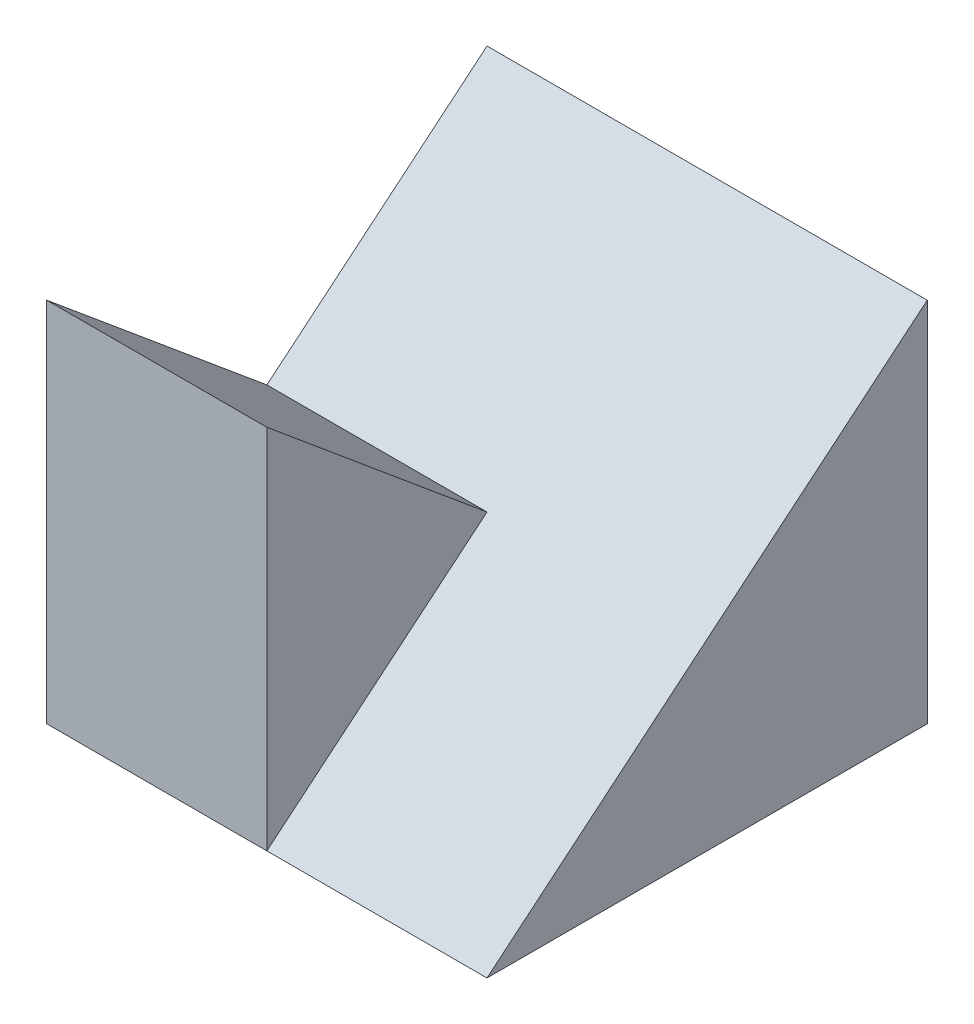
ISO-10303-21;
HEADER;
FILE_DESCRIPTION(('STEP AP214'),'2;1');
FILE_NAME('part.step','',(''),(''),'','','');
FILE_SCHEMA(('AUTOMOTIVE_DESIGN { 1 0 10303 214 1 1 1 1 }'));
ENDSEC;
DATA;
#1=APPLICATION_CONTEXT('core data for automotive mechanical design processes');
#2=APPLICATION_PROTOCOL_DEFINITION('international standard','automotive_design',2000,#1);
#3=PRODUCT_CONTEXT('',#1,'mechanical');
#4=PRODUCT('Part','Part','',(#3));
#5=PRODUCT_RELATED_PRODUCT_CATEGORY('part','',(#4));
#6=PRODUCT_DEFINITION_FORMATION('','',#4);
#7=PRODUCT_DEFINITION_CONTEXT('part definition',#1,'design');
#8=PRODUCT_DEFINITION('design','',#6,#7);
#9=PRODUCT_DEFINITION_SHAPE('','',#8);
#10=(LENGTH_UNIT() NAMED_UNIT(*) SI_UNIT(.MILLI.,.METRE.));
#11=(NAMED_UNIT(*) PLANE_ANGLE_UNIT() SI_UNIT($,.RADIAN.));
#12=(NAMED_UNIT(*) SI_UNIT($,.STERADIAN.) SOLID_ANGLE_UNIT());
#13=UNCERTAINTY_MEASURE_WITH_UNIT(LENGTH_MEASURE(1.E-05),#10,'distance_accuracy_value','');
#14=(GEOMETRIC_REPRESENTATION_CONTEXT(3) GLOBAL_UNCERTAINTY_ASSIGNED_CONTEXT((#13)) GLOBAL_UNIT_ASSIGNED_CONTEXT((#10,
#11,#12)) REPRESENTATION_CONTEXT('',''));
#15=CARTESIAN_POINT('',(0.,0.,0.));
#16=DIRECTION('',(0.,0.,1.));
#17=DIRECTION('',(1.,0.,0.));
#18=AXIS2_PLACEMENT_3D('',#15,#16,#17);
#19=CARTESIAN_POINT('',(3.,5.,3.));
#20=DIRECTION('',(-1.,0.,0.));
#21=DIRECTION('',(0.,0.,1.));
#22=AXIS2_PLACEMENT_3D('',#19,#20,#21);
#23=PLANE('',#22);
#24=DIRECTION('',(0.,-0.64018439966448,0.768221279597376));
#25=VECTOR('',#24,1.);
#26=CARTESIAN_POINT('',(3.,2.04918032786885,0.540983606557377));
#27=LINE('',#26,#25);
#28=CARTESIAN_POINT('',(3.,5.,-3.));
#29=VERTEX_POINT('',#28);
#30=CARTESIAN_POINT('',(3.,0.,3.));
#31=VERTEX_POINT('',#30);
#32=EDGE_CURVE('E108',#29,#31,#27,.T.);
#33=ORIENTED_EDGE('',*,*,#32,.T.);
#34=DIRECTION('',(0.,0.,-1.));
#35=VECTOR('',#34,1.);
#36=CARTESIAN_POINT('',(3.,0.,3.));
#37=LINE('',#36,#35);
#38=CARTESIAN_POINT('',(3.,0.,-3.));
#39=VERTEX_POINT('',#38);
#40=EDGE_CURVE('E81',#31,#39,#37,.T.);
#41=ORIENTED_EDGE('',*,*,#40,.T.);
#42=DIRECTION('',(0.,-1.,0.));
#43=VECTOR('',#42,1.);
#44=CARTESIAN_POINT('',(3.,5.,-3.));
#45=LINE('',#44,#43);
#46=EDGE_CURVE('E11',#29,#39,#45,.T.);
#47=ORIENTED_EDGE('',*,*,#46,.F.);
#48=EDGE_LOOP('',(#33,#41,#47));
#49=FACE_BOUND('',#48,.T.);
#50=ADVANCED_FACE('F33',(#49),#23,.F.);
#51=CARTESIAN_POINT('',(-3.,5.,3.));
#52=DIRECTION('',(0.,0.,-1.));
#53=DIRECTION('',(-1.,0.,0.));
#54=AXIS2_PLACEMENT_3D('',#51,#52,#53);
#55=PLANE('',#54);
#56=DIRECTION('',(0.,-1.,0.));
#57=VECTOR('',#56,1.);
#58=CARTESIAN_POINT('',(0.,0.,3.));
#59=LINE('',#58,#57);
#60=CARTESIAN_POINT('',(0.,5.,3.));
#61=VERTEX_POINT('',#60);
#62=CARTESIAN_POINT('',(0.,0.,3.));
#63=VERTEX_POINT('',#62);
#64=EDGE_CURVE('E121',#61,#63,#59,.T.);
#65=ORIENTED_EDGE('',*,*,#64,.F.);
#66=DIRECTION('',(1.,0.,0.));
#67=VECTOR('',#66,1.);
#68=CARTESIAN_POINT('',(-3.,5.,3.));
#69=LINE('',#68,#67);
#70=CARTESIAN_POINT('',(-3.,5.,3.));
#71=VERTEX_POINT('',#70);
#72=EDGE_CURVE('E100',#71,#61,#69,.T.);
#73=ORIENTED_EDGE('',*,*,#72,.F.);
#74=DIRECTION('',(0.,-1.,0.));
#75=VECTOR('',#74,1.);
#76=CARTESIAN_POINT('',(-3.,5.,3.));
#77=LINE('',#76,#75);
#78=CARTESIAN_POINT('',(-3.,0.,3.));
#79=VERTEX_POINT('',#78);
#80=EDGE_CURVE('E89',#71,#79,#77,.T.);
#81=ORIENTED_EDGE('',*,*,#80,.T.);
#82=DIRECTION('',(1.,0.,0.));
#83=VECTOR('',#82,1.);
#84=CARTESIAN_POINT('',(-3.,0.,3.));
#85=LINE('',#84,#83);
#86=EDGE_CURVE('E94',#79,#63,#85,.T.);
#87=ORIENTED_EDGE('',*,*,#86,.T.);
#88=EDGE_LOOP('',(#65,#73,#81,#87));
#89=FACE_BOUND('',#88,.T.);
#90=ADVANCED_FACE('F133',(#89),#55,.F.);
#91=CARTESIAN_POINT('',(7.,1.47540983606557,-1.22950819672131));
#92=DIRECTION('',(0.,-0.768221279597376,0.64018439966448));
#93=DIRECTION('',(0.,-0.64018439966448,-0.768221279597376));
#94=AXIS2_PLACEMENT_3D('',#91,#92,#93);
#95=PLANE('',#94);
#96=DIRECTION('',(0.,0.64018439966448,0.768221279597376));
#97=VECTOR('',#96,1.);
#98=CARTESIAN_POINT('',(0.,1.47540983606557,-1.22950819672131));
#99=LINE('',#98,#97);
#100=CARTESIAN_POINT('',(0.,2.5,0.));
#101=VERTEX_POINT('',#100);
#102=EDGE_CURVE('E123',#101,#61,#99,.T.);
#103=ORIENTED_EDGE('',*,*,#102,.F.);
#104=DIRECTION('',(-1.,0.,0.));
#105=VECTOR('',#104,1.);
#106=CARTESIAN_POINT('',(7.,2.5,0.));
#107=LINE('',#106,#105);
#108=CARTESIAN_POINT('',(-3.,2.5,0.));
#109=VERTEX_POINT('',#108);
#110=EDGE_CURVE('E111',#101,#109,#107,.T.);
#111=ORIENTED_EDGE('',*,*,#110,.T.);
#112=DIRECTION('',(0.,0.64018439966448,0.768221279597376));
#113=VECTOR('',#112,1.);
#114=CARTESIAN_POINT('',(-3.,1.47540983606557,-1.22950819672131));
#115=LINE('',#114,#113);
#116=EDGE_CURVE('E56',#109,#71,#115,.T.);
#117=ORIENTED_EDGE('',*,*,#116,.T.);
#118=ORIENTED_EDGE('',*,*,#72,.T.);
#119=EDGE_LOOP('',(#103,#111,#117,#118));
#120=FACE_BOUND('',#119,.T.);
#121=ADVANCED_FACE('F135',(#120),#95,.F.);
#122=CARTESIAN_POINT('',(-3.,5.,-3.));
#123=DIRECTION('',(0.,0.,1.));
#124=DIRECTION('',(1.,0.,0.));
#125=AXIS2_PLACEMENT_3D('',#122,#123,#124);
#126=PLANE('',#125);
#127=DIRECTION('',(-1.,0.,0.));
#128=VECTOR('',#127,1.);
#129=CARTESIAN_POINT('',(-3.,0.,-3.));
#130=LINE('',#129,#128);
#131=CARTESIAN_POINT('',(-3.,0.,-3.));
#132=VERTEX_POINT('',#131);
#133=EDGE_CURVE('E70',#39,#132,#130,.T.);
#134=ORIENTED_EDGE('',*,*,#133,.T.);
#135=DIRECTION('',(0.,-1.,0.));
#136=VECTOR('',#135,1.);
#137=CARTESIAN_POINT('',(-3.,5.,-3.));
#138=LINE('',#137,#136);
#139=CARTESIAN_POINT('',(-3.,5.,-3.));
#140=VERTEX_POINT('',#139);
#141=EDGE_CURVE('E40',#140,#132,#138,.T.);
#142=ORIENTED_EDGE('',*,*,#141,.F.);
#143=DIRECTION('',(-1.,0.,0.));
#144=VECTOR('',#143,1.);
#145=CARTESIAN_POINT('',(-3.,5.,-3.));
#146=LINE('',#145,#144);
#147=EDGE_CURVE('E96',#29,#140,#146,.T.);
#148=ORIENTED_EDGE('',*,*,#147,.F.);
#149=ORIENTED_EDGE('',*,*,#46,.T.);
#150=EDGE_LOOP('',(#134,#142,#148,#149));
#151=FACE_BOUND('',#150,.T.);
#152=ADVANCED_FACE('F72',(#151),#126,.F.);
#153=CARTESIAN_POINT('',(-3.,5.,3.));
#154=DIRECTION('',(1.,0.,0.));
#155=DIRECTION('',(0.,0.,-1.));
#156=AXIS2_PLACEMENT_3D('',#153,#154,#155);
#157=PLANE('',#156);
#158=ORIENTED_EDGE('',*,*,#116,.F.);
#159=DIRECTION('',(0.,-0.64018439966448,0.768221279597376));
#160=VECTOR('',#159,1.);
#161=CARTESIAN_POINT('',(-3.,1.47540983606557,1.22950819672131));
#162=LINE('',#161,#160);
#163=EDGE_CURVE('E88',#140,#109,#162,.T.);
#164=ORIENTED_EDGE('',*,*,#163,.F.);
#165=ORIENTED_EDGE('',*,*,#141,.T.);
#166=DIRECTION('',(0.,0.,1.));
#167=VECTOR('',#166,1.);
#168=CARTESIAN_POINT('',(-3.,0.,3.));
#169=LINE('',#168,#167);
#170=EDGE_CURVE('E80',#132,#79,#169,.T.);
#171=ORIENTED_EDGE('',*,*,#170,.T.);
#172=ORIENTED_EDGE('',*,*,#80,.F.);
#173=EDGE_LOOP('',(#158,#164,#165,#171,#172));
#174=FACE_BOUND('',#173,.T.);
#175=ADVANCED_FACE('F85',(#174),#157,.F.);
#176=CARTESIAN_POINT('',(0.,0.,0.));
#177=DIRECTION('',(0.,-1.,0.));
#178=DIRECTION('',(0.,0.,-1.));
#179=AXIS2_PLACEMENT_3D('',#176,#177,#178);
#180=PLANE('',#179);
#181=ORIENTED_EDGE('',*,*,#40,.F.);
#182=DIRECTION('',(1.,0.,0.));
#183=VECTOR('',#182,1.);
#184=CARTESIAN_POINT('',(0.,0.,3.));
#185=LINE('',#184,#183);
#186=EDGE_CURVE('E119',#63,#31,#185,.T.);
#187=ORIENTED_EDGE('',*,*,#186,.F.);
#188=ORIENTED_EDGE('',*,*,#86,.F.);
#189=ORIENTED_EDGE('',*,*,#170,.F.);
#190=ORIENTED_EDGE('',*,*,#133,.F.);
#191=EDGE_LOOP('',(#181,#187,#188,#189,#190));
#192=FACE_BOUND('',#191,.T.);
#193=ADVANCED_FACE('F91',(#192),#180,.T.);
#194=CARTESIAN_POINT('',(7.,1.47540983606557,1.22950819672131));
#195=DIRECTION('',(0.,-0.768221279597376,-0.64018439966448));
#196=DIRECTION('',(0.,0.64018439966448,-0.768221279597376));
#197=AXIS2_PLACEMENT_3D('',#194,#195,#196);
#198=PLANE('',#197);
#199=ORIENTED_EDGE('',*,*,#147,.T.);
#200=ORIENTED_EDGE('',*,*,#163,.T.);
#201=ORIENTED_EDGE('',*,*,#110,.F.);
#202=DIRECTION('',(0.,-0.64018439966448,0.768221279597376));
#203=VECTOR('',#202,1.);
#204=CARTESIAN_POINT('',(0.,1.47540983606557,1.22950819672131));
#205=LINE('',#204,#203);
#206=EDGE_CURVE('E47',#101,#63,#205,.T.);
#207=ORIENTED_EDGE('',*,*,#206,.T.);
#208=ORIENTED_EDGE('',*,*,#186,.T.);
#209=ORIENTED_EDGE('',*,*,#32,.F.);
#210=EDGE_LOOP('',(#199,#200,#201,#207,#208,#209));
#211=FACE_BOUND('',#210,.T.);
#212=ADVANCED_FACE('F128',(#211),#198,.F.);
#213=CARTESIAN_POINT('',(0.,0.,0.));
#214=DIRECTION('',(1.,0.,0.));
#215=DIRECTION('',(0.,0.,-1.));
#216=AXIS2_PLACEMENT_3D('',#213,#214,#215);
#217=PLANE('',#216);
#218=ORIENTED_EDGE('',*,*,#206,.F.);
#219=ORIENTED_EDGE('',*,*,#102,.T.);
#220=ORIENTED_EDGE('',*,*,#64,.T.);
#221=EDGE_LOOP('',(#218,#219,#220));
#222=FACE_BOUND('',#221,.T.);
#223=ADVANCED_FACE('F132',(#222),#217,.T.);
#224=CLOSED_SHELL('',(#50,#90,#121,#152,#175,#193,#212,#223));
#225=MANIFOLD_SOLID_BREP('B2',#224);
#226=ADVANCED_BREP_SHAPE_REPRESENTATION('',(#18,#225),#14);
#227=SHAPE_DEFINITION_REPRESENTATION(#9,#226);
ENDSEC;
END-ISO-10303-21;
